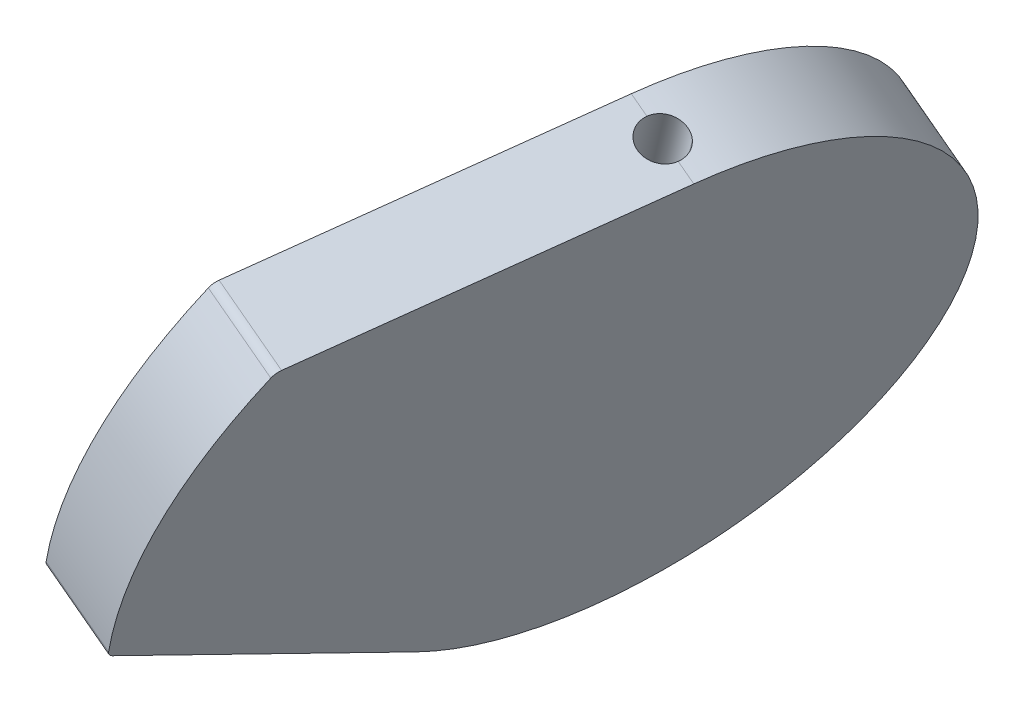
ISO-10303-21;
HEADER;
FILE_DESCRIPTION(('STEP AP214'),'2;1');
FILE_NAME('part.step','',(''),(''),'','','');
FILE_SCHEMA(('AUTOMOTIVE_DESIGN { 1 0 10303 214 1 1 1 1 }'));
ENDSEC;
DATA;
#1=APPLICATION_CONTEXT('core data for automotive mechanical design processes');
#2=APPLICATION_PROTOCOL_DEFINITION('international standard','automotive_design',2000,#1);
#3=PRODUCT_CONTEXT('',#1,'mechanical');
#4=PRODUCT('Part','Part','',(#3));
#5=PRODUCT_RELATED_PRODUCT_CATEGORY('part','',(#4));
#6=PRODUCT_DEFINITION_FORMATION('','',#4);
#7=PRODUCT_DEFINITION_CONTEXT('part definition',#1,'design');
#8=PRODUCT_DEFINITION('design','',#6,#7);
#9=PRODUCT_DEFINITION_SHAPE('','',#8);
#10=(LENGTH_UNIT() NAMED_UNIT(*) SI_UNIT(.MILLI.,.METRE.));
#11=(NAMED_UNIT(*) PLANE_ANGLE_UNIT() SI_UNIT($,.RADIAN.));
#12=(NAMED_UNIT(*) SI_UNIT($,.STERADIAN.) SOLID_ANGLE_UNIT());
#13=UNCERTAINTY_MEASURE_WITH_UNIT(LENGTH_MEASURE(1.E-05),#10,'distance_accuracy_value','');
#14=(GEOMETRIC_REPRESENTATION_CONTEXT(3) GLOBAL_UNCERTAINTY_ASSIGNED_CONTEXT((#13)) GLOBAL_UNIT_ASSIGNED_CONTEXT((#10,
#11,#12)) REPRESENTATION_CONTEXT('',''));
#15=CARTESIAN_POINT('',(0.,0.,0.));
#16=DIRECTION('',(0.,0.,1.));
#17=DIRECTION('',(1.,0.,0.));
#18=AXIS2_PLACEMENT_3D('',#15,#16,#17);
#19=CARTESIAN_POINT('',(-139.637086332881,59.6748367074424,-154.801559046835));
#20=DIRECTION('',(0.416083095012873,0.811605253037911,-0.410087516617828));
#21=DIRECTION('',(-0.0142366093573998,-0.445109851437649,-0.895362797477737));
#22=AXIS2_PLACEMENT_3D('',#19,#20,#21);
#23=PLANE('',#22);
#24=CARTESIAN_POINT('',(-139.637086332881,59.6748367074424,-154.801559046835));
#25=DIRECTION('',(0.416083095012873,0.811605253037911,-0.410087516617828));
#26=DIRECTION('',(0.0142366093573984,0.44510985143765,0.895362797477737));
#27=AXIS2_PLACEMENT_3D('',#24,#25,#26);
#28=CIRCLE('',#27,1.);
#29=CARTESIAN_POINT('',(-140.085481092826,59.4656228151936,-155.670565195569));
#30=VERTEX_POINT('',#29);
#31=CARTESIAN_POINT('',(-139.188691572941,59.8840505996841,-153.932552898095));
#32=VERTEX_POINT('',#31);
#33=EDGE_CURVE('E117',#30,#32,#28,.T.);
#34=ORIENTED_EDGE('',*,*,#33,.F.);
#35=CARTESIAN_POINT('',(-139.637086332881,59.6748367074424,-154.801559046835));
#36=DIRECTION('',(0.416083095012873,0.811605253037911,-0.410087516617828));
#37=DIRECTION('',(0.0142366093573984,0.44510985143765,0.895362797477737));
#38=AXIS2_PLACEMENT_3D('',#35,#36,#37);
#39=CIRCLE('',#38,1.);
#40=EDGE_CURVE('E42',#32,#30,#39,.T.);
#41=ORIENTED_EDGE('',*,*,#40,.F.);
#42=EDGE_LOOP('',(#34,#41));
#43=FACE_BOUND('',#42,.T.);
#44=ADVANCED_FACE('F17',(#43),#23,.F.);
#45=CARTESIAN_POINT('',(-141.968891699705,51.1332806444211,-149.687032631984));
#46=DIRECTION('',(-0.416083095012873,-0.811605253037911,0.410087516617828));
#47=DIRECTION('',(-0.0142366093573998,-0.445109851437649,-0.895362797477737));
#48=AXIS2_PLACEMENT_3D('',#45,#46,#47);
#49=PLANE('',#48);
#50=DIRECTION('',(-0.909215143405846,0.378383579710355,-0.173648177666983));
#51=VECTOR('',#50,1.);
#52=CARTESIAN_POINT('',(-142.574463251018,51.385298368739,-149.80268886263));
#53=LINE('',#52,#51);
#54=CARTESIAN_POINT('',(-141.968891699705,51.1332806444211,-149.687032631984));
#55=VERTEX_POINT('',#54);
#56=CARTESIAN_POINT('',(-143.18003479895,51.6373160901053,-149.91834509565));
#57=VERTEX_POINT('',#56);
#58=EDGE_CURVE('E116',#55,#57,#53,.T.);
#59=ORIENTED_EDGE('',*,*,#58,.F.);
#60=DIRECTION('',(0.0142366093573999,0.44510985143765,0.895362797477737));
#61=VECTOR('',#60,1.);
#62=CARTESIAN_POINT('',(-141.853442600874,54.7428150450797,-142.426256874941));
#63=LINE('',#62,#61);
#64=CARTESIAN_POINT('',(-141.737993502084,58.3523494456752,-135.165481117822));
#65=VERTEX_POINT('',#64);
#66=EDGE_CURVE('E11',#55,#65,#63,.T.);
#67=ORIENTED_EDGE('',*,*,#66,.T.);
#68=DIRECTION('',(-0.909215143405846,0.378383579710355,-0.173648177666983));
#69=VECTOR('',#68,1.);
#70=CARTESIAN_POINT('',(-143.556423788896,59.1091166050959,-135.512777473156));
#71=LINE('',#70,#69);
#72=CARTESIAN_POINT('',(-145.374854075707,59.8658837645166,-135.86007382849));
#73=VERTEX_POINT('',#72);
#74=EDGE_CURVE('E33',#65,#73,#71,.T.);
#75=ORIENTED_EDGE('',*,*,#74,.T.);
#76=DIRECTION('',(0.0142366093573999,0.44510985143765,0.895362797477737));
#77=VECTOR('',#76,1.);
#78=CARTESIAN_POINT('',(-145.490303174497,56.2563493639211,-143.120849585609));
#79=LINE('',#78,#77);
#80=CARTESIAN_POINT('',(-145.605752273328,52.6468149632625,-150.381625342652));
#81=VERTEX_POINT('',#80);
#82=EDGE_CURVE('E226',#81,#73,#79,.T.);
#83=ORIENTED_EDGE('',*,*,#82,.F.);
#84=DIRECTION('',(-0.909215143405846,0.378383579710355,-0.173648177666983));
#85=VECTOR('',#84,1.);
#86=CARTESIAN_POINT('',(-145.00018072202,52.3947972389464,-150.265969112007));
#87=LINE('',#86,#85);
#88=CARTESIAN_POINT('',(-144.394609174192,52.1427795145343,-150.150312885046));
#89=VERTEX_POINT('',#88);
#90=EDGE_CURVE('E142',#89,#81,#87,.T.);
#91=ORIENTED_EDGE('',*,*,#90,.F.);
#92=CARTESIAN_POINT('',(-143.797917283018,51.5587841770474,-150.700683880649));
#93=DIRECTION('',(-0.416083095012873,-0.811605253037911,0.410087516617828));
#94=DIRECTION('',(0.0142366093573984,0.44510985143765,0.895362797477737));
#95=AXIS2_PLACEMENT_3D('',#92,#93,#94);
#96=CIRCLE('',#95,1.);
#97=CARTESIAN_POINT('',(-143.349522523066,51.7679980693133,-149.831677731921));
#98=VERTEX_POINT('',#97);
#99=EDGE_CURVE('E126',#98,#89,#96,.T.);
#100=ORIENTED_EDGE('',*,*,#99,.F.);
#101=CARTESIAN_POINT('',(-143.797917283018,51.5587841770474,-150.700683880649));
#102=DIRECTION('',(-0.416083095012873,-0.811605253037911,0.410087516617828));
#103=DIRECTION('',(0.0142366093573984,0.44510985143765,0.895362797477737));
#104=AXIS2_PLACEMENT_3D('',#101,#102,#103);
#105=CIRCLE('',#104,1.);
#106=EDGE_CURVE('E118',#57,#98,#105,.T.);
#107=ORIENTED_EDGE('',*,*,#106,.F.);
#108=EDGE_LOOP('',(#59,#67,#75,#83,#91,#100,#107));
#109=FACE_BOUND('',#108,.T.);
#110=ADVANCED_FACE('F164',(#109),#49,.T.);
#111=CARTESIAN_POINT('',(-138.37867534977,62.4277672660514,-155.39184801151));
#112=DIRECTION('',(-0.909215143405846,0.378383579710355,-0.173648177666983));
#113=DIRECTION('',(-0.0151801111816388,-0.4469491584612,-0.894430552908016));
#114=AXIS2_PLACEMENT_3D('',#111,#112,#113);
#115=CYLINDRICAL_SURFACE('',#114,13.);
#116=ORIENTED_EDGE('',*,*,#90,.T.);
#117=CARTESIAN_POINT('',(-140.197105636582,63.1845344254721,-155.739144366844));
#118=DIRECTION('',(-0.909215143405846,0.378383579710355,-0.173648177666983));
#119=DIRECTION('',(0.0151801111816389,0.4469491584612,0.894430552908016));
#120=AXIS2_PLACEMENT_3D('',#117,#118,#119);
#121=CIRCLE('',#120,13.);
#122=CARTESIAN_POINT('',(-135.64367102096,75.1534025317911,-153.500298803693));
#123=VERTEX_POINT('',#122);
#124=EDGE_CURVE('E221',#123,#81,#121,.T.);
#125=ORIENTED_EDGE('',*,*,#124,.F.);
#126=DIRECTION('',(-0.909215143405846,0.378383579710355,-0.173648177666983));
#127=VECTOR('',#126,1.);
#128=CARTESIAN_POINT('',(-135.64367102096,75.1534025317911,-153.500298803693));
#129=LINE('',#128,#127);
#130=CARTESIAN_POINT('',(-134.734435714737,74.7750105610034,-153.326646775194));
#131=VERTEX_POINT('',#130);
#132=EDGE_CURVE('E215',#131,#123,#129,.T.);
#133=ORIENTED_EDGE('',*,*,#132,.F.);
#134=CARTESIAN_POINT('',(-133.200895789962,74.2721855030984,-153.932326068201));
#135=CARTESIAN_POINT('',(-133.220584465224,74.2819493650477,-153.949808749462));
#136=CARTESIAN_POINT('',(-133.240996003141,74.2918705716239,-153.96636810708));
#137=CARTESIAN_POINT('',(-133.283130957213,74.3119815559253,-153.997538349309));
#138=CARTESIAN_POINT('',(-133.304854328569,74.3221713244724,-154.012149300404));
#139=CARTESIAN_POINT('',(-133.371723725795,74.3530430909001,-154.05286601112));
#140=CARTESIAN_POINT('',(-133.418631467937,74.3740583824609,-154.075910944709));
#141=CARTESIAN_POINT('',(-133.515714737263,74.4164272212215,-154.113088064733));
#142=CARTESIAN_POINT('',(-133.565891999058,74.4377809433507,-154.12721547688));
#143=CARTESIAN_POINT('',(-133.668069938075,74.4802429828233,-154.146147247744));
#144=CARTESIAN_POINT('',(-133.720070200882,74.5013513545067,-154.150953711536));
#145=CARTESIAN_POINT('',(-133.824369901879,74.5426698589752,-154.151115921473));
#146=CARTESIAN_POINT('',(-133.876668932892,74.5628809853435,-154.146482402137));
#147=CARTESIAN_POINT('',(-133.98018847457,74.601780121252,-154.12793927982));
#148=CARTESIAN_POINT('',(-134.031408785132,74.6204678500163,-154.114027971175));
#149=CARTESIAN_POINT('',(-134.131447763278,74.6556913174744,-154.07732048679));
#150=CARTESIAN_POINT('',(-134.180262429515,74.6722235413587,-154.054510035819));
#151=CARTESIAN_POINT('',(-134.27408216543,74.7024764660244,-154.000685580763));
#152=CARTESIAN_POINT('',(-134.319087757128,74.7161975524299,-153.969672703203));
#153=CARTESIAN_POINT('',(-134.404194483204,74.7403040675971,-153.900266823561));
#154=CARTESIAN_POINT('',(-134.444284214006,74.7506818280734,-153.861857173781));
#155=CARTESIAN_POINT('',(-134.518384690815,74.7676043974913,-153.778793064444));
#156=CARTESIAN_POINT('',(-134.552392440554,74.7741473208077,-153.734135546097));
#157=CARTESIAN_POINT('',(-134.61339473076,74.7830690340174,-153.639875990097));
#158=CARTESIAN_POINT('',(-134.640387174178,74.7854465799924,-153.590272480081));
#159=CARTESIAN_POINT('',(-134.686562624896,74.785858150883,-153.487630708593));
#160=CARTESIAN_POINT('',(-134.705762153161,74.7839014219649,-153.434599992609));
#161=CARTESIAN_POINT('',(-134.725818799687,74.7784398934581,-153.362735337677));
#162=CARTESIAN_POINT('',(-134.730360298746,74.7768429473096,-153.344726839039));
#163=CARTESIAN_POINT('',(-134.734435714743,74.7750105609885,-153.326646775197));
#164=B_SPLINE_CURVE_WITH_KNOTS('',3,(#134,#135,#136,#137,#138,#139,#140,#141,#142,#143,#144,
#145,#146,#147,#148,#149,#150,#151,#152,#153,#154,#155,#156,#157,#158,#159,#160,#161,#162,#163),
.UNSPECIFIED.,.F.,.F.,(4,2,2,2,2,2,2,2,2,2,2,2,2,2,4),(0.,0.0841957414292987,0.168388609165156,
0.336510945675849,0.504723215814585,0.672897491889677,0.840880638121017,1.00889467550392,
1.17717934194237,1.34544090806607,1.51408569751306,1.68281334175628,1.85159136502988,
2.02000968651526,2.07590017859205),.UNSPECIFIED.);
#165=CARTESIAN_POINT('',(-133.200895789962,74.2721855030984,-153.932326068201));
#166=VERTEX_POINT('',#165);
#167=EDGE_CURVE('E169',#166,#131,#164,.T.);
#168=ORIENTED_EDGE('',*,*,#167,.F.);
#169=CARTESIAN_POINT('',(-133.200895789962,74.2721855030984,-153.932326068201));
#170=CARTESIAN_POINT('',(-133.181143967127,74.2623896347748,-153.914786651008));
#171=CARTESIAN_POINT('',(-133.162138625059,74.2527614453266,-153.896334799954));
#172=CARTESIAN_POINT('',(-133.125742566134,74.2338791412886,-153.857728170597));
#173=CARTESIAN_POINT('',(-133.108351763725,74.2246250068925,-153.837573482635));
#174=CARTESIAN_POINT('',(-133.058844284253,74.1975150890525,-153.774815826662));
#175=CARTESIAN_POINT('',(-133.029315507995,74.1802737529988,-153.729850737726));
#176=CARTESIAN_POINT('',(-132.978145680219,74.1477888895916,-153.63499207548));
#177=CARTESIAN_POINT('',(-132.95650744169,74.132546075952,-153.585096752574));
#178=CARTESIAN_POINT('',(-132.9217813083,74.104315043401,-153.48178362233));
#179=CARTESIAN_POINT('',(-132.908696460154,74.0913276290706,-153.428364567289));
#180=CARTESIAN_POINT('',(-132.89152046526,74.0678455019635,-153.319559929427));
#181=CARTESIAN_POINT('',(-132.88743195037,74.0573515194356,-153.264173775949));
#182=CARTESIAN_POINT('',(-132.888429378052,74.0390768629978,-153.153116834014));
#183=CARTESIAN_POINT('',(-132.893497762517,74.0312910304135,-153.097446793965));
#184=CARTESIAN_POINT('',(-132.906719986346,74.02250028099,-153.021301645751));
#185=CARTESIAN_POINT('',(-132.911054137907,74.0202714422848,-153.0002558331));
#186=CARTESIAN_POINT('',(-132.916045753577,74.0182601836927,-152.979358121533));
#187=B_SPLINE_CURVE_WITH_KNOTS('',3,(#169,#170,#171,#172,#173,#174,#175,#176,#177,#178,#179,
#180,#181,#182,#183,#184,#185,#186),.UNSPECIFIED.,.F.,.F.,(4,2,2,2,2,2,2,2,4),(0.,
0.0844672208634157,0.168929963296245,0.337529969115204,0.506190022442554,0.674910119747377,
0.843679569198262,1.01212575114891,1.07688459622703),.UNSPECIFIED.);
#188=CARTESIAN_POINT('',(-132.916045753571,74.0182601837076,-152.97935812153));
#189=VERTEX_POINT('',#188);
#190=EDGE_CURVE('E144',#166,#189,#187,.T.);
#191=ORIENTED_EDGE('',*,*,#190,.T.);
#192=DIRECTION('',(-0.909215143405846,0.378383579710355,-0.173648177666983));
#193=VECTOR('',#192,1.);
#194=CARTESIAN_POINT('',(-135.64367102096,75.1534025317911,-153.500298803693));
#195=LINE('',#194,#193);
#196=CARTESIAN_POINT('',(-132.006810447337,73.6398682129497,-152.805706093025));
#197=VERTEX_POINT('',#196);
#198=EDGE_CURVE('E220',#197,#189,#195,.T.);
#199=ORIENTED_EDGE('',*,*,#198,.F.);
#200=CARTESIAN_POINT('',(-136.560245062958,61.6710001066307,-155.044551656176));
#201=DIRECTION('',(-0.909215143405846,0.378383579710355,-0.173648177666983));
#202=DIRECTION('',(0.0151801111816392,0.4469491584612,0.894430552908015));
#203=AXIS2_PLACEMENT_3D('',#200,#201,#202);
#204=CIRCLE('',#203,13.);
#205=EDGE_CURVE('E140',#197,#55,#204,.T.);
#206=ORIENTED_EDGE('',*,*,#205,.T.);
#207=ORIENTED_EDGE('',*,*,#58,.T.);
#208=CARTESIAN_POINT('',(-144.205596172774,51.428990031784,-151.609819201404));
#209=CARTESIAN_POINT('',(-144.182822459297,51.4151024068944,-151.618226413813));
#210=CARTESIAN_POINT('',(-144.159573987439,51.4013766803129,-151.625571752282));
#211=CARTESIAN_POINT('',(-144.112277022482,51.3743189192091,-151.638088307316));
#212=CARTESIAN_POINT('',(-144.088228539915,51.360986879508,-151.643259552493));
#213=CARTESIAN_POINT('',(-144.015179653781,51.3217249638089,-151.655424679569));
#214=CARTESIAN_POINT('',(-143.965206461981,51.2964871327543,-151.65909551442));
#215=CARTESIAN_POINT('',(-143.86419708132,51.2485573808435,-151.657375321519));
#216=CARTESIAN_POINT('',(-143.813160238967,51.2258670833091,-151.651978550341));
#217=CARTESIAN_POINT('',(-143.71150732053,51.1836647850557,-151.632258548167));
#218=CARTESIAN_POINT('',(-143.660891134726,51.1641519291888,-151.617937723935));
#219=CARTESIAN_POINT('',(-143.561644397044,51.1289318737362,-151.580850782132));
#220=CARTESIAN_POINT('',(-143.513008678243,51.1132141626527,-151.558108443589));
#221=CARTESIAN_POINT('',(-143.418890872748,51.0860178608578,-151.504864671466));
#222=CARTESIAN_POINT('',(-143.373409401163,51.0745400951007,-151.474361729875));
#223=CARTESIAN_POINT('',(-143.28664768771,51.0562130787812,-151.406395929535));
#224=CARTESIAN_POINT('',(-143.245384203932,51.0493817240223,-151.368906861429));
#225=CARTESIAN_POINT('',(-143.16832431942,51.0407344141426,-151.288177849119));
#226=CARTESIAN_POINT('',(-143.13252780827,51.0389183577142,-151.244938021099));
#227=CARTESIAN_POINT('',(-143.067050509579,51.040497302134,-151.153632552416));
#228=CARTESIAN_POINT('',(-143.037418805328,51.0439324335078,-151.105532397923));
#229=CARTESIAN_POINT('',(-142.985370097384,51.0561351976877,-151.006204999304));
#230=CARTESIAN_POINT('',(-142.962953340168,51.0649030126395,-150.954977648418));
#231=CARTESIAN_POINT('',(-142.925843185185,51.0876916611942,-150.850713439718));
#232=CARTESIAN_POINT('',(-142.91117616429,51.1017301602661,-150.797671048073));
#233=CARTESIAN_POINT('',(-142.890067356876,51.134755546739,-150.69148904887));
#234=CARTESIAN_POINT('',(-142.883625513564,51.1537423999728,-150.638349441984));
#235=CARTESIAN_POINT('',(-142.879155071574,51.1961085408357,-150.53367251891));
#236=CARTESIAN_POINT('',(-142.881101172354,51.2194744163577,-150.482130855912));
#237=CARTESIAN_POINT('',(-142.893317853497,51.2699675999618,-150.381954792383));
#238=CARTESIAN_POINT('',(-142.903588567389,51.2970949683731,-150.3333204385));
#239=CARTESIAN_POINT('',(-142.932139656109,51.3541538193741,-150.240531243425));
#240=CARTESIAN_POINT('',(-142.950386689744,51.3840732260481,-150.196358688026));
#241=CARTESIAN_POINT('',(-142.994425304435,51.445857328186,-150.113485501809));
#242=CARTESIAN_POINT('',(-143.020212973934,51.4777210083321,-150.074782049401));
#243=CARTESIAN_POINT('',(-143.068449267087,51.5310686033573,-150.016249852477));
#244=CARTESIAN_POINT('',(-143.088934290694,51.5523037590555,-149.994541287182));
#245=CARTESIAN_POINT('',(-143.132551710242,51.5948297723706,-149.954142085654));
#246=CARTESIAN_POINT('',(-143.155680023341,51.6161204957478,-149.935446899792));
#247=CARTESIAN_POINT('',(-143.180034798905,51.6373160900748,-149.918345095683));
#248=B_SPLINE_CURVE_WITH_KNOTS('',3,(#208,#209,#210,#211,#212,#213,#214,#215,#216,#217,#218,
#219,#220,#221,#222,#223,#224,#225,#226,#227,#228,#229,#230,#231,#232,#233,#234,#235,#236,#237,
#238,#239,#240,#241,#242,#243,#244,#245,#246,#247),.UNSPECIFIED.,.F.,.F.,(4,2,2,2,2,2,2,2,2,2,2,
2,2,2,2,2,2,2,2,4),(0.,0.0838522068751349,0.167703310207071,0.335153485616951,0.502709764040081,
0.670220873080026,0.837262559419827,1.00433672949541,1.17205080158007,1.33976148586049,
1.50876026791579,1.6777648226984,1.84734095236593,2.01691591118233,2.18597973986142,
2.35504628040339,2.52341277768438,2.69169209262152,2.8013802888017,2.91090129316082),.UNSPECIFIED.);
#249=CARTESIAN_POINT('',(-144.205596172774,51.428990031784,-151.609819201404));
#250=VERTEX_POINT('',#249);
#251=EDGE_CURVE('E22',#250,#57,#248,.T.);
#252=ORIENTED_EDGE('',*,*,#251,.F.);
#253=CARTESIAN_POINT('',(-144.205596172774,51.428990031784,-151.609819201404));
#254=CARTESIAN_POINT('',(-144.251628477488,51.4570457561297,-151.592874272191));
#255=CARTESIAN_POINT('',(-144.295627260401,51.4857364240542,-151.571536865216));
#256=CARTESIAN_POINT('',(-144.378335953313,51.5436928755423,-151.520964668442));
#257=CARTESIAN_POINT('',(-144.417050016582,51.5729581865593,-151.49173613472));
#258=CARTESIAN_POINT('',(-144.488055356385,51.6314250063721,-151.426229217349));
#259=CARTESIAN_POINT('',(-144.52034456884,51.6606264916926,-151.38994857548));
#260=CARTESIAN_POINT('',(-144.577513266093,51.7182804939019,-151.31145458356));
#261=CARTESIAN_POINT('',(-144.602393935391,51.7467331298549,-151.269242183486));
#262=CARTESIAN_POINT('',(-144.644029921793,51.8022815143225,-151.180017968047));
#263=CARTESIAN_POINT('',(-144.660766855937,51.8293740703127,-151.132995581711));
#264=CARTESIAN_POINT('',(-144.685499044776,51.8814532739686,-151.035594538495));
#265=CARTESIAN_POINT('',(-144.693493119064,51.9064396368489,-150.985215429385));
#266=CARTESIAN_POINT('',(-144.70045564845,51.953551788513,-150.882718375291));
#267=CARTESIAN_POINT('',(-144.699451431055,51.9756860315153,-150.830606173638));
#268=CARTESIAN_POINT('',(-144.688496374595,52.016532293728,-150.725982588839));
#269=CARTESIAN_POINT('',(-144.678545944978,52.0352444695111,-150.67347122407));
#270=CARTESIAN_POINT('',(-144.650064473736,52.0685746675743,-150.569748441073));
#271=CARTESIAN_POINT('',(-144.631569058506,52.0832092880602,-150.518532547873));
#272=CARTESIAN_POINT('',(-144.586576755443,52.1079606775375,-150.418592675851));
#273=CARTESIAN_POINT('',(-144.56008376174,52.1180796393354,-150.369867497737));
#274=CARTESIAN_POINT('',(-144.51031882542,52.1307457528686,-150.292392862824));
#275=CARTESIAN_POINT('',(-144.489078999398,52.1347003751418,-150.262542292472));
#276=CARTESIAN_POINT('',(-144.443844249904,52.1404057989745,-150.204855416086));
#277=CARTESIAN_POINT('',(-144.419853589476,52.1421599615874,-150.177016099451));
#278=CARTESIAN_POINT('',(-144.394609174233,52.1427795145396,-150.150312885095));
#279=B_SPLINE_CURVE_WITH_KNOTS('',3,(#253,#254,#255,#256,#257,#258,#259,#260,#261,#262,#263,
#264,#265,#266,#267,#268,#269,#270,#271,#272,#273,#274,#275,#276,#277,#278),.UNSPECIFIED.,.F.,
.F.,(4,2,2,2,2,2,2,2,2,2,2,2,4),(0.,0.169290640745995,0.338447460176318,0.507658536323672,
0.676842543968238,0.846406701318745,1.01599374935271,1.18506594223103,1.35413039746533,
1.52249625071995,1.69078025621599,1.80111759234921,1.91128618962398),.UNSPECIFIED.);
#280=EDGE_CURVE('E114',#250,#89,#279,.T.);
#281=ORIENTED_EDGE('',*,*,#280,.T.);
#282=EDGE_LOOP('',(#116,#125,#133,#168,#191,#199,#206,#207,#252,#281));
#283=FACE_BOUND('',#282,.T.);
#284=ADVANCED_FACE('F113',(#283),#115,.T.);
#285=CARTESIAN_POINT('',(-136.560245062958,61.6710001066307,-155.044551656176));
#286=DIRECTION('',(-0.909215143405846,0.378383579710355,-0.173648177666983));
#287=DIRECTION('',(-0.015180111181639,-0.4469491584612,-0.894430552908015));
#288=AXIS2_PLACEMENT_3D('',#285,#286,#287);
#289=PLANE('',#288);
#290=DIRECTION('',(0.225039579538637,0.0957612820500731,-0.969632386268734));
#291=VECTOR('',#290,1.);
#292=CARTESIAN_POINT('',(-133.835040634089,72.8618998798612,-144.928375348591));
#293=LINE('',#292,#291);
#294=CARTESIAN_POINT('',(-135.663270820824,72.0839315468052,-137.051044604173));
#295=VERTEX_POINT('',#294);
#296=EDGE_CURVE('E218',#295,#197,#293,.T.);
#297=ORIENTED_EDGE('',*,*,#296,.F.);
#298=CARTESIAN_POINT('',(-135.838402921425,71.6235904657884,-137.13715404892));
#299=DIRECTION('',(-0.909215143405846,0.378383579710355,-0.173648177666983));
#300=DIRECTION('',(0.0151801111816361,0.446949158461194,0.894430552908019));
#301=AXIS2_PLACEMENT_3D('',#298,#299,#300);
#302=CIRCLE('',#301,0.5);
#303=CARTESIAN_POINT('',(-135.820797015532,71.8663365721423,-136.700388253558));
#304=VERTEX_POINT('',#303);
#305=EDGE_CURVE('E234',#304,#295,#302,.T.);
#306=ORIENTED_EDGE('',*,*,#305,.F.);
#307=CARTESIAN_POINT('',(-136.560245062958,61.6710001066307,-155.044551656176));
#308=DIRECTION('',(-0.909215143405846,0.378383579710355,-0.173648177666983));
#309=DIRECTION('',(0.015180111181639,0.4469491584612,0.894430552908016));
#310=AXIS2_PLACEMENT_3D('',#307,#308,#309);
#311=CIRCLE('',#310,21.);
#312=CARTESIAN_POINT('',(-141.651164317773,58.6871069981798,-134.890670564505));
#313=VERTEX_POINT('',#312);
#314=EDGE_CURVE('E239',#313,#304,#311,.T.);
#315=ORIENTED_EDGE('',*,*,#314,.F.);
#316=CARTESIAN_POINT('',(-141.529951954544,58.7581520722464,-135.370524876192));
#317=DIRECTION('',(-0.909215143405846,0.378383579710355,-0.173648177666983));
#318=DIRECTION('',(0.0151801111816408,0.446949158461204,0.894430552908014));
#319=AXIS2_PLACEMENT_3D('',#316,#317,#318);
#320=CIRCLE('',#319,0.5);
#321=EDGE_CURVE('E128',#65,#313,#320,.T.);
#322=ORIENTED_EDGE('',*,*,#321,.F.);
#323=ORIENTED_EDGE('',*,*,#66,.F.);
#324=ORIENTED_EDGE('',*,*,#205,.F.);
#325=EDGE_LOOP('',(#297,#306,#315,#322,#323,#324));
#326=FACE_BOUND('',#325,.T.);
#327=ADVANCED_FACE('F163',(#326),#289,.F.);
#328=CARTESIAN_POINT('',(-143.348382241356,59.5149192316671,-135.717821231526));
#329=DIRECTION('',(-0.909215143405846,0.378383579710355,-0.173648177666983));
#330=DIRECTION('',(-0.0151801111816408,-0.446949158461204,-0.894430552908014));
#331=AXIS2_PLACEMENT_3D('',#328,#329,#330);
#332=CYLINDRICAL_SURFACE('',#331,0.5);
#333=ORIENTED_EDGE('',*,*,#74,.F.);
#334=ORIENTED_EDGE('',*,*,#321,.T.);
#335=DIRECTION('',(-0.909215143405846,0.378383579710355,-0.173648177666983));
#336=VECTOR('',#335,1.);
#337=CARTESIAN_POINT('',(-145.288024891397,60.2006413170212,-135.585263275173));
#338=LINE('',#337,#336);
#339=CARTESIAN_POINT('',(-145.288024891397,60.2006413170212,-135.585263275173));
#340=VERTEX_POINT('',#339);
#341=EDGE_CURVE('E243',#313,#340,#338,.T.);
#342=ORIENTED_EDGE('',*,*,#341,.T.);
#343=CARTESIAN_POINT('',(-145.166812528167,60.2716863910878,-136.06511758686));
#344=DIRECTION('',(-0.909215143405846,0.378383579710355,-0.173648177666983));
#345=DIRECTION('',(0.0151801111816408,0.446949158461204,0.894430552908014));
#346=AXIS2_PLACEMENT_3D('',#343,#344,#345);
#347=CIRCLE('',#346,0.5);
#348=EDGE_CURVE('E229',#73,#340,#347,.T.);
#349=ORIENTED_EDGE('',*,*,#348,.F.);
#350=EDGE_LOOP('',(#333,#334,#342,#349));
#351=FACE_BOUND('',#350,.T.);
#352=ADVANCED_FACE('F283',(#351),#332,.T.);
#353=CARTESIAN_POINT('',(-133.858768457289,74.3052048979481,-153.176681801972));
#354=DIRECTION('',(-0.350264201200409,-0.920682162022108,-0.172218889474228));
#355=DIRECTION('',(0.225039579538646,0.0957612820500697,-0.969632386268732));
#356=AXIS2_PLACEMENT_3D('',#353,#354,#355);
#357=CYLINDRICAL_SURFACE('',#356,1.);
#358=CARTESIAN_POINT('',(-133.823742037174,74.3972731141384,-153.159459913027));
#359=DIRECTION('',(0.350264201200409,0.920682162022108,0.172218889474228));
#360=DIRECTION('',(-0.225039579538646,-0.0957612820500697,0.969632386268732));
#361=AXIS2_PLACEMENT_3D('',#358,#359,#360);
#362=CIRCLE('',#361,1.);
#363=CARTESIAN_POINT('',(-134.457133807767,74.4946414343608,-152.391778810472));
#364=VERTEX_POINT('',#363);
#365=EDGE_CURVE('E136',#364,#189,#362,.T.);
#366=ORIENTED_EDGE('',*,*,#365,.T.);
#367=ORIENTED_EDGE('',*,*,#190,.F.);
#368=DIRECTION('',(0.350264201200409,0.920682162022108,0.172218889474228));
#369=VECTOR('',#368,1.);
#370=CARTESIAN_POINT('',(-133.187775327053,74.3066731159231,-153.925874961998));
#371=LINE('',#370,#369);
#372=CARTESIAN_POINT('',(-136.692992278615,65.0930831736385,-155.649329910289));
#373=VERTEX_POINT('',#372);
#374=EDGE_CURVE('E211',#373,#166,#371,.T.);
#375=ORIENTED_EDGE('',*,*,#374,.F.);
#376=CARTESIAN_POINT('',(-137.326384049183,65.1904514939109,-154.881648807756));
#377=DIRECTION('',(-0.350264201200409,-0.920682162022108,-0.172218889474228));
#378=DIRECTION('',(-0.225039579538646,-0.0957612820500697,0.969632386268732));
#379=AXIS2_PLACEMENT_3D('',#376,#377,#378);
#380=CIRCLE('',#379,1.);
#381=CARTESIAN_POINT('',(-137.959775819751,65.2878198141774,-154.113967705236));
#382=VERTEX_POINT('',#381);
#383=EDGE_CURVE('E248',#373,#382,#380,.T.);
#384=ORIENTED_EDGE('',*,*,#383,.T.);
#385=DIRECTION('',(0.350264201200409,0.920682162022108,0.172218889474228));
#386=VECTOR('',#385,1.);
#387=CARTESIAN_POINT('',(-134.454558868197,74.5014097564444,-152.39051275694));
#388=LINE('',#387,#386);
#389=EDGE_CURVE('E237',#382,#364,#388,.T.);
#390=ORIENTED_EDGE('',*,*,#389,.T.);
#391=EDGE_LOOP('',(#366,#367,#375,#384,#390));
#392=FACE_BOUND('',#391,.T.);
#393=ADVANCED_FACE('F155',(#392),#357,.F.);
#394=CARTESIAN_POINT('',(-137.326384049183,65.1904514939109,-154.881648807756));
#395=DIRECTION('',(-0.350264201200409,-0.920682162022108,-0.172218889474228));
#396=DIRECTION('',(0.225039579538637,0.0957612820500734,-0.969632386268734));
#397=AXIS2_PLACEMENT_3D('',#394,#395,#396);
#398=PLANE('',#397);
#399=ORIENTED_EDGE('',*,*,#383,.F.);
#400=CARTESIAN_POINT('',(-137.326384049183,65.1904514939109,-154.881648807756));
#401=DIRECTION('',(-0.350264201200409,-0.920682162022108,-0.172218889474228));
#402=DIRECTION('',(-0.225039579538646,-0.0957612820500697,0.969632386268732));
#403=AXIS2_PLACEMENT_3D('',#400,#401,#402);
#404=CIRCLE('',#403,1.);
#405=EDGE_CURVE('E214',#382,#373,#404,.T.);
#406=ORIENTED_EDGE('',*,*,#405,.F.);
#407=EDGE_LOOP('',(#399,#406));
#408=FACE_BOUND('',#407,.T.);
#409=ADVANCED_FACE('F277',(#408),#398,.F.);
#410=CARTESIAN_POINT('',(-137.656833208236,72.3803576252092,-137.484450404254));
#411=DIRECTION('',(-0.909215143405846,0.378383579710355,-0.173648177666983));
#412=DIRECTION('',(-0.0151801111816361,-0.446949158461194,-0.894430552908018));
#413=AXIS2_PLACEMENT_3D('',#410,#411,#412);
#414=CYLINDRICAL_SURFACE('',#413,0.5);
#415=DIRECTION('',(-0.909215143405846,0.378383579710355,-0.173648177666983));
#416=VECTOR('',#415,1.);
#417=CARTESIAN_POINT('',(-139.457657589155,73.3798708909837,-137.394980964226));
#418=LINE('',#417,#416);
#419=CARTESIAN_POINT('',(-139.457657589155,73.3798708909837,-137.394980964226));
#420=VERTEX_POINT('',#419);
#421=EDGE_CURVE('E176',#304,#420,#418,.T.);
#422=ORIENTED_EDGE('',*,*,#421,.F.);
#423=ORIENTED_EDGE('',*,*,#305,.T.);
#424=DIRECTION('',(-0.909215143405846,0.378383579710355,-0.173648177666983));
#425=VECTOR('',#424,1.);
#426=CARTESIAN_POINT('',(-139.300131394447,73.5974658656466,-137.745637314841));
#427=LINE('',#426,#425);
#428=CARTESIAN_POINT('',(-139.300131394447,73.5974658656466,-137.745637314841));
#429=VERTEX_POINT('',#428);
#430=EDGE_CURVE('E238',#295,#429,#427,.T.);
#431=ORIENTED_EDGE('',*,*,#430,.T.);
#432=CARTESIAN_POINT('',(-139.475263495048,73.1371247846299,-137.831746759588));
#433=DIRECTION('',(-0.909215143405846,0.378383579710355,-0.173648177666983));
#434=DIRECTION('',(0.0151801111816361,0.446949158461194,0.894430552908019));
#435=AXIS2_PLACEMENT_3D('',#432,#433,#434);
#436=CIRCLE('',#435,0.5);
#437=EDGE_CURVE('E258',#420,#429,#436,.T.);
#438=ORIENTED_EDGE('',*,*,#437,.F.);
#439=EDGE_LOOP('',(#422,#423,#431,#438));
#440=FACE_BOUND('',#439,.T.);
#441=ADVANCED_FACE('F267',(#440),#414,.T.);
#442=CARTESIAN_POINT('',(-138.37867534977,62.4277672660514,-155.39184801151));
#443=DIRECTION('',(-0.909215143405846,0.378383579710355,-0.173648177666983));
#444=DIRECTION('',(-0.015180111181639,-0.4469491584612,-0.894430552908015));
#445=AXIS2_PLACEMENT_3D('',#442,#443,#444);
#446=CYLINDRICAL_SURFACE('',#445,21.);
#447=ORIENTED_EDGE('',*,*,#341,.F.);
#448=ORIENTED_EDGE('',*,*,#314,.T.);
#449=ORIENTED_EDGE('',*,*,#421,.T.);
#450=CARTESIAN_POINT('',(-140.197105636582,63.1845344254721,-155.739144366844));
#451=DIRECTION('',(-0.909215143405846,0.378383579710355,-0.173648177666983));
#452=DIRECTION('',(0.0151801111816386,0.446949158461199,0.894430552908016));
#453=AXIS2_PLACEMENT_3D('',#450,#451,#452);
#454=CIRCLE('',#453,21.);
#455=EDGE_CURVE('E247',#340,#420,#454,.T.);
#456=ORIENTED_EDGE('',*,*,#455,.F.);
#457=EDGE_LOOP('',(#447,#448,#449,#456));
#458=FACE_BOUND('',#457,.T.);
#459=ADVANCED_FACE('F184',(#458),#446,.T.);
#460=CARTESIAN_POINT('',(-133.858768457289,74.3052048979481,-153.176681801972));
#461=DIRECTION('',(-0.350264201200409,-0.920682162022108,-0.172218889474228));
#462=DIRECTION('',(0.225039579538646,0.0957612820500697,-0.969632386268732));
#463=AXIS2_PLACEMENT_3D('',#460,#461,#462);
#464=CYLINDRICAL_SURFACE('',#463,1.);
#465=ORIENTED_EDGE('',*,*,#167,.T.);
#466=CARTESIAN_POINT('',(-133.823742037174,74.3972731141384,-153.159459913027));
#467=DIRECTION('',(0.350264201200409,0.920682162022108,0.172218889474228));
#468=DIRECTION('',(-0.225039579538646,-0.0957612820500697,0.969632386268732));
#469=AXIS2_PLACEMENT_3D('',#466,#467,#468);
#470=CIRCLE('',#469,1.);
#471=EDGE_CURVE('E177',#131,#364,#470,.T.);
#472=ORIENTED_EDGE('',*,*,#471,.T.);
#473=ORIENTED_EDGE('',*,*,#389,.F.);
#474=ORIENTED_EDGE('',*,*,#405,.T.);
#475=ORIENTED_EDGE('',*,*,#374,.T.);
#476=EDGE_LOOP('',(#465,#472,#473,#474,#475));
#477=FACE_BOUND('',#476,.T.);
#478=ADVANCED_FACE('F178',(#477),#464,.F.);
#479=CARTESIAN_POINT('',(-135.663270820824,72.0839315468052,-137.051044604173));
#480=DIRECTION('',(0.350264201200409,0.920682162022108,0.172218889474228));
#481=DIRECTION('',(-0.225039579538637,-0.0957612820500734,0.969632386268734));
#482=AXIS2_PLACEMENT_3D('',#479,#480,#481);
#483=PLANE('',#482);
#484=ORIENTED_EDGE('',*,*,#132,.T.);
#485=DIRECTION('',(0.225039579538637,0.0957612820500731,-0.969632386268734));
#486=VECTOR('',#485,1.);
#487=CARTESIAN_POINT('',(-137.471901207712,74.3754341987026,-145.622968059259));
#488=LINE('',#487,#486);
#489=EDGE_CURVE('E131',#429,#123,#488,.T.);
#490=ORIENTED_EDGE('',*,*,#489,.F.);
#491=ORIENTED_EDGE('',*,*,#430,.F.);
#492=ORIENTED_EDGE('',*,*,#296,.T.);
#493=ORIENTED_EDGE('',*,*,#198,.T.);
#494=ORIENTED_EDGE('',*,*,#365,.F.);
#495=ORIENTED_EDGE('',*,*,#471,.F.);
#496=EDGE_LOOP('',(#484,#490,#491,#492,#493,#494,#495));
#497=FACE_BOUND('',#496,.T.);
#498=ADVANCED_FACE('F183',(#497),#483,.T.);
#499=CARTESIAN_POINT('',(-140.197105636582,63.1845344254721,-155.739144366844));
#500=DIRECTION('',(-0.909215143405846,0.378383579710355,-0.173648177666983));
#501=DIRECTION('',(-0.015180111181639,-0.4469491584612,-0.894430552908015));
#502=AXIS2_PLACEMENT_3D('',#499,#500,#501);
#503=PLANE('',#502);
#504=ORIENTED_EDGE('',*,*,#124,.T.);
#505=ORIENTED_EDGE('',*,*,#82,.T.);
#506=ORIENTED_EDGE('',*,*,#348,.T.);
#507=ORIENTED_EDGE('',*,*,#455,.T.);
#508=ORIENTED_EDGE('',*,*,#437,.T.);
#509=ORIENTED_EDGE('',*,*,#489,.T.);
#510=EDGE_LOOP('',(#504,#505,#506,#507,#508,#509));
#511=FACE_BOUND('',#510,.T.);
#512=ADVANCED_FACE('F189',(#511),#503,.T.);
#513=CARTESIAN_POINT('',(-143.75630897351,51.6399447023643,-150.741692632317));
#514=DIRECTION('',(0.416083095012873,0.811605253037911,-0.410087516617828));
#515=DIRECTION('',(0.0142366093573984,0.44510985143765,0.895362797477737));
#516=AXIS2_PLACEMENT_3D('',#513,#514,#515);
#517=CYLINDRICAL_SURFACE('',#516,1.);
#518=ORIENTED_EDGE('',*,*,#99,.T.);
#519=ORIENTED_EDGE('',*,*,#280,.F.);
#520=DIRECTION('',(0.416083095012873,0.811605253037911,-0.410087516617828));
#521=VECTOR('',#520,1.);
#522=CARTESIAN_POINT('',(-142.244225987104,55.2548083957551,-153.542926886497));
#523=LINE('',#522,#521);
#524=EDGE_CURVE('E123',#250,#30,#523,.T.);
#525=ORIENTED_EDGE('',*,*,#524,.T.);
#526=ORIENTED_EDGE('',*,*,#33,.T.);
#527=DIRECTION('',(0.416083095012873,0.811605253037911,-0.410087516617828));
#528=VECTOR('',#527,1.);
#529=CARTESIAN_POINT('',(-141.34743646722,55.6732361802442,-151.804914589025));
#530=LINE('',#529,#528);
#531=EDGE_CURVE('E139',#98,#32,#530,.T.);
#532=ORIENTED_EDGE('',*,*,#531,.F.);
#533=EDGE_LOOP('',(#518,#519,#525,#526,#532));
#534=FACE_BOUND('',#533,.T.);
#535=ADVANCED_FACE('F121',(#534),#517,.F.);
#536=CARTESIAN_POINT('',(-143.75630897351,51.6399447023643,-150.741692632317));
#537=DIRECTION('',(0.416083095012873,0.811605253037911,-0.410087516617828));
#538=DIRECTION('',(0.0142366093573984,0.44510985143765,0.895362797477737));
#539=AXIS2_PLACEMENT_3D('',#536,#537,#538);
#540=CYLINDRICAL_SURFACE('',#539,1.);
#541=ORIENTED_EDGE('',*,*,#251,.T.);
#542=ORIENTED_EDGE('',*,*,#106,.T.);
#543=ORIENTED_EDGE('',*,*,#531,.T.);
#544=ORIENTED_EDGE('',*,*,#40,.T.);
#545=ORIENTED_EDGE('',*,*,#524,.F.);
#546=EDGE_LOOP('',(#541,#542,#543,#544,#545));
#547=FACE_BOUND('',#546,.T.);
#548=ADVANCED_FACE('F19',(#547),#540,.F.);
#549=CLOSED_SHELL('',(#44,#110,#284,#327,#352,#393,#409,#441,#459,#478,#498,#512,#535,#548));
#550=MANIFOLD_SOLID_BREP('B1',#549);
#551=ADVANCED_BREP_SHAPE_REPRESENTATION('',(#18,#550),#14);
#552=SHAPE_DEFINITION_REPRESENTATION(#9,#551);
ENDSEC;
END-ISO-10303-21;
